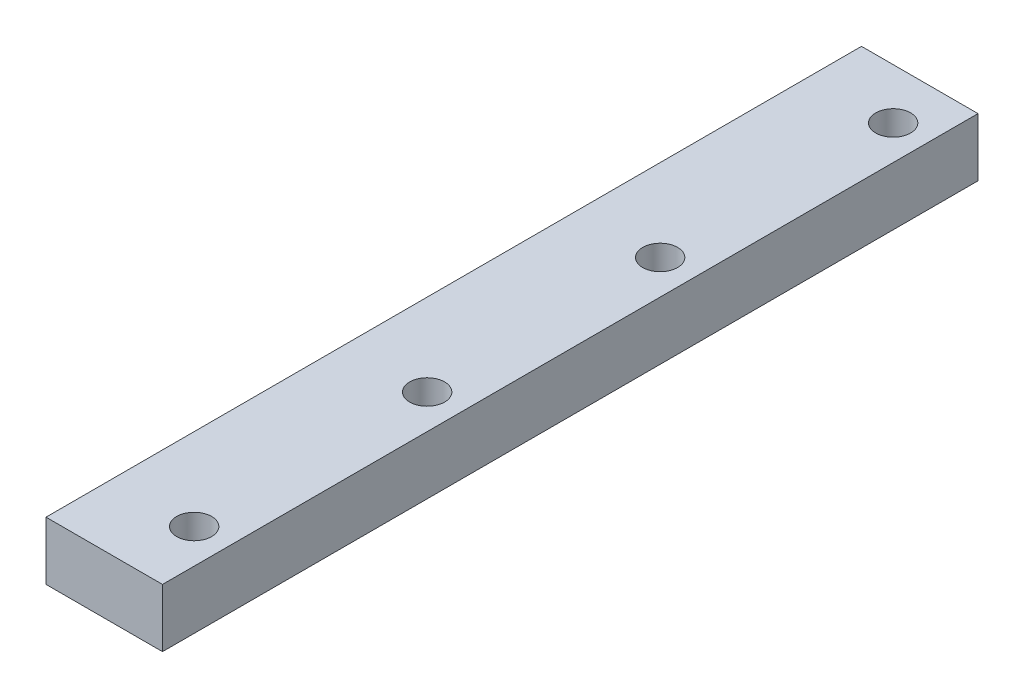
ISO-10303-21;
HEADER;
FILE_DESCRIPTION(('STEP AP214'),'2;1');
FILE_NAME('part.step','',(''),(''),'','','');
FILE_SCHEMA(('AUTOMOTIVE_DESIGN { 1 0 10303 214 1 1 1 1 }'));
ENDSEC;
DATA;
#1=APPLICATION_CONTEXT('core data for automotive mechanical design processes');
#2=APPLICATION_PROTOCOL_DEFINITION('international standard','automotive_design',2000,#1);
#3=PRODUCT_CONTEXT('',#1,'mechanical');
#4=PRODUCT('Part','Part','',(#3));
#5=PRODUCT_RELATED_PRODUCT_CATEGORY('part','',(#4));
#6=PRODUCT_DEFINITION_FORMATION('','',#4);
#7=PRODUCT_DEFINITION_CONTEXT('part definition',#1,'design');
#8=PRODUCT_DEFINITION('design','',#6,#7);
#9=PRODUCT_DEFINITION_SHAPE('','',#8);
#10=(LENGTH_UNIT() NAMED_UNIT(*) SI_UNIT(.MILLI.,.METRE.));
#11=(NAMED_UNIT(*) PLANE_ANGLE_UNIT() SI_UNIT($,.RADIAN.));
#12=(NAMED_UNIT(*) SI_UNIT($,.STERADIAN.) SOLID_ANGLE_UNIT());
#13=UNCERTAINTY_MEASURE_WITH_UNIT(LENGTH_MEASURE(1.E-05),#10,'distance_accuracy_value','');
#14=(GEOMETRIC_REPRESENTATION_CONTEXT(3) GLOBAL_UNCERTAINTY_ASSIGNED_CONTEXT((#13)) GLOBAL_UNIT_ASSIGNED_CONTEXT((#10,
#11,#12)) REPRESENTATION_CONTEXT('',''));
#15=CARTESIAN_POINT('',(0.,0.,0.));
#16=DIRECTION('',(0.,0.,1.));
#17=DIRECTION('',(1.,0.,0.));
#18=AXIS2_PLACEMENT_3D('',#15,#16,#17);
#19=CARTESIAN_POINT('',(14.1085621825044,-119.812030075188,128.673667422913));
#20=DIRECTION('',(0.,1.,0.));
#21=DIRECTION('',(-1.,0.,0.));
#22=AXIS2_PLACEMENT_3D('',#19,#20,#21);
#23=CYLINDRICAL_SURFACE('',#22,3.);
#24=CARTESIAN_POINT('',(14.1085621825043,20.187969924812,128.673667422913));
#25=DIRECTION('',(0.,1.,0.));
#26=DIRECTION('',(-1.,0.,0.));
#27=AXIS2_PLACEMENT_3D('',#24,#25,#26);
#28=CIRCLE('',#27,3.);
#29=CARTESIAN_POINT('',(11.1085621825043,20.187969924812,128.673667422913));
#30=VERTEX_POINT('',#29);
#31=EDGE_CURVE('E42',#30,#30,#28,.T.);
#32=ORIENTED_EDGE('',*,*,#31,.T.);
#33=EDGE_LOOP('',(#32));
#34=FACE_BOUND('',#33,.T.);
#35=CARTESIAN_POINT('',(14.1085621825043,10.187969924812,128.673667422913));
#36=DIRECTION('',(0.,1.,0.));
#37=DIRECTION('',(-1.,0.,0.));
#38=AXIS2_PLACEMENT_3D('',#35,#36,#37);
#39=CIRCLE('',#38,3.);
#40=CARTESIAN_POINT('',(11.1085621825043,10.187969924812,128.673667422913));
#41=VERTEX_POINT('',#40);
#42=EDGE_CURVE('E11',#41,#41,#39,.T.);
#43=ORIENTED_EDGE('',*,*,#42,.F.);
#44=EDGE_LOOP('',(#43));
#45=FACE_BOUND('',#44,.T.);
#46=ADVANCED_FACE('F34',(#34,#45),#23,.F.);
#47=CARTESIAN_POINT('',(14.1085621825044,-119.812030075188,88.673667422913));
#48=DIRECTION('',(0.,1.,0.));
#49=DIRECTION('',(-1.,0.,0.));
#50=AXIS2_PLACEMENT_3D('',#47,#48,#49);
#51=CYLINDRICAL_SURFACE('',#50,3.);
#52=CARTESIAN_POINT('',(14.1085621825043,20.187969924812,88.673667422913));
#53=DIRECTION('',(0.,1.,0.));
#54=DIRECTION('',(-1.,0.,0.));
#55=AXIS2_PLACEMENT_3D('',#52,#53,#54);
#56=CIRCLE('',#55,3.);
#57=CARTESIAN_POINT('',(11.1085621825043,20.187969924812,88.673667422913));
#58=VERTEX_POINT('',#57);
#59=EDGE_CURVE('E112',#58,#58,#56,.T.);
#60=ORIENTED_EDGE('',*,*,#59,.T.);
#61=EDGE_LOOP('',(#60));
#62=FACE_BOUND('',#61,.T.);
#63=CARTESIAN_POINT('',(14.1085621825043,10.187969924812,88.673667422913));
#64=DIRECTION('',(0.,1.,0.));
#65=DIRECTION('',(-1.,0.,0.));
#66=AXIS2_PLACEMENT_3D('',#63,#64,#65);
#67=CIRCLE('',#66,3.);
#68=CARTESIAN_POINT('',(11.1085621825043,10.187969924812,88.673667422913));
#69=VERTEX_POINT('',#68);
#70=EDGE_CURVE('E118',#69,#69,#67,.T.);
#71=ORIENTED_EDGE('',*,*,#70,.F.);
#72=EDGE_LOOP('',(#71));
#73=FACE_BOUND('',#72,.T.);
#74=ADVANCED_FACE('F135',(#62,#73),#51,.F.);
#75=CARTESIAN_POINT('',(20.,10.187969924812,140.));
#76=DIRECTION('',(-1.,0.,0.));
#77=DIRECTION('',(0.,0.,1.));
#78=AXIS2_PLACEMENT_3D('',#75,#76,#77);
#79=PLANE('',#78);
#80=DIRECTION('',(0.,1.,0.));
#81=VECTOR('',#80,1.);
#82=CARTESIAN_POINT('',(20.,10.187969924812,0.));
#83=LINE('',#82,#81);
#84=CARTESIAN_POINT('',(20.,10.187969924812,0.));
#85=VERTEX_POINT('',#84);
#86=CARTESIAN_POINT('',(20.,20.187969924812,0.));
#87=VERTEX_POINT('',#86);
#88=EDGE_CURVE('E102',#85,#87,#83,.T.);
#89=ORIENTED_EDGE('',*,*,#88,.T.);
#90=DIRECTION('',(0.,0.,-1.));
#91=VECTOR('',#90,1.);
#92=CARTESIAN_POINT('',(20.,20.187969924812,140.));
#93=LINE('',#92,#91);
#94=CARTESIAN_POINT('',(20.,20.187969924812,140.));
#95=VERTEX_POINT('',#94);
#96=EDGE_CURVE('E93',#95,#87,#93,.T.);
#97=ORIENTED_EDGE('',*,*,#96,.F.);
#98=DIRECTION('',(0.,1.,0.));
#99=VECTOR('',#98,1.);
#100=CARTESIAN_POINT('',(20.,10.187969924812,140.));
#101=LINE('',#100,#99);
#102=CARTESIAN_POINT('',(20.,10.187969924812,140.));
#103=VERTEX_POINT('',#102);
#104=EDGE_CURVE('E86',#103,#95,#101,.T.);
#105=ORIENTED_EDGE('',*,*,#104,.F.);
#106=DIRECTION('',(0.,0.,-1.));
#107=VECTOR('',#106,1.);
#108=CARTESIAN_POINT('',(20.,10.187969924812,140.));
#109=LINE('',#108,#107);
#110=EDGE_CURVE('E98',#103,#85,#109,.T.);
#111=ORIENTED_EDGE('',*,*,#110,.T.);
#112=EDGE_LOOP('',(#89,#97,#105,#111));
#113=FACE_BOUND('',#112,.T.);
#114=ADVANCED_FACE('F126',(#113),#79,.F.);
#115=CARTESIAN_POINT('',(20.,20.187969924812,140.));
#116=DIRECTION('',(0.,-1.,0.));
#117=DIRECTION('',(1.,0.,0.));
#118=AXIS2_PLACEMENT_3D('',#115,#116,#117);
#119=PLANE('',#118);
#120=CARTESIAN_POINT('',(14.1085621825043,20.187969924812,48.673667422913));
#121=DIRECTION('',(0.,1.,0.));
#122=DIRECTION('',(-1.,0.,0.));
#123=AXIS2_PLACEMENT_3D('',#120,#121,#122);
#124=CIRCLE('',#123,3.);
#125=CARTESIAN_POINT('',(11.1085621825043,20.187969924812,48.673667422913));
#126=VERTEX_POINT('',#125);
#127=EDGE_CURVE('E178',#126,#126,#124,.T.);
#128=ORIENTED_EDGE('',*,*,#127,.F.);
#129=EDGE_LOOP('',(#128));
#130=FACE_BOUND('',#129,.T.);
#131=CARTESIAN_POINT('',(14.1085621825043,20.187969924812,8.67366742291299));
#132=DIRECTION('',(0.,1.,0.));
#133=DIRECTION('',(-1.,0.,0.));
#134=AXIS2_PLACEMENT_3D('',#131,#132,#133);
#135=CIRCLE('',#134,3.);
#136=CARTESIAN_POINT('',(11.1085621825043,20.187969924812,8.67366742291299));
#137=VERTEX_POINT('',#136);
#138=EDGE_CURVE('E115',#137,#137,#135,.T.);
#139=ORIENTED_EDGE('',*,*,#138,.F.);
#140=EDGE_LOOP('',(#139));
#141=FACE_BOUND('',#140,.T.);
#142=DIRECTION('',(-1.,0.,0.));
#143=VECTOR('',#142,1.);
#144=CARTESIAN_POINT('',(20.,20.187969924812,0.));
#145=LINE('',#144,#143);
#146=CARTESIAN_POINT('',(0.,20.187969924812,0.));
#147=VERTEX_POINT('',#146);
#148=EDGE_CURVE('E92',#87,#147,#145,.T.);
#149=ORIENTED_EDGE('',*,*,#148,.T.);
#150=DIRECTION('',(0.,0.,-1.));
#151=VECTOR('',#150,1.);
#152=CARTESIAN_POINT('',(0.,20.187969924812,140.));
#153=LINE('',#152,#151);
#154=CARTESIAN_POINT('',(0.,20.187969924812,140.));
#155=VERTEX_POINT('',#154);
#156=EDGE_CURVE('E89',#155,#147,#153,.T.);
#157=ORIENTED_EDGE('',*,*,#156,.F.);
#158=DIRECTION('',(-1.,0.,0.));
#159=VECTOR('',#158,1.);
#160=CARTESIAN_POINT('',(20.,20.187969924812,140.));
#161=LINE('',#160,#159);
#162=EDGE_CURVE('E81',#95,#155,#161,.T.);
#163=ORIENTED_EDGE('',*,*,#162,.F.);
#164=ORIENTED_EDGE('',*,*,#96,.T.);
#165=EDGE_LOOP('',(#149,#157,#163,#164));
#166=FACE_BOUND('',#165,.T.);
#167=ORIENTED_EDGE('',*,*,#59,.F.);
#168=EDGE_LOOP('',(#167));
#169=FACE_BOUND('',#168,.T.);
#170=ORIENTED_EDGE('',*,*,#31,.F.);
#171=EDGE_LOOP('',(#170));
#172=FACE_BOUND('',#171,.T.);
#173=ADVANCED_FACE('F90',(#130,#141,#166,#169,#172),#119,.F.);
#174=CARTESIAN_POINT('',(0.,20.187969924812,140.));
#175=DIRECTION('',(1.,0.,0.));
#176=DIRECTION('',(0.,1.,0.));
#177=AXIS2_PLACEMENT_3D('',#174,#175,#176);
#178=PLANE('',#177);
#179=DIRECTION('',(0.,-1.,0.));
#180=VECTOR('',#179,1.);
#181=CARTESIAN_POINT('',(0.,20.187969924812,0.));
#182=LINE('',#181,#180);
#183=CARTESIAN_POINT('',(0.,10.187969924812,0.));
#184=VERTEX_POINT('',#183);
#185=EDGE_CURVE('E67',#147,#184,#182,.T.);
#186=ORIENTED_EDGE('',*,*,#185,.T.);
#187=DIRECTION('',(0.,0.,-1.));
#188=VECTOR('',#187,1.);
#189=CARTESIAN_POINT('',(0.,10.187969924812,140.));
#190=LINE('',#189,#188);
#191=CARTESIAN_POINT('',(0.,10.187969924812,140.));
#192=VERTEX_POINT('',#191);
#193=EDGE_CURVE('E94',#192,#184,#190,.T.);
#194=ORIENTED_EDGE('',*,*,#193,.F.);
#195=DIRECTION('',(0.,-1.,0.));
#196=VECTOR('',#195,1.);
#197=CARTESIAN_POINT('',(0.,20.187969924812,140.));
#198=LINE('',#197,#196);
#199=EDGE_CURVE('E84',#155,#192,#198,.T.);
#200=ORIENTED_EDGE('',*,*,#199,.F.);
#201=ORIENTED_EDGE('',*,*,#156,.T.);
#202=EDGE_LOOP('',(#186,#194,#200,#201));
#203=FACE_BOUND('',#202,.T.);
#204=ADVANCED_FACE('F96',(#203),#178,.F.);
#205=CARTESIAN_POINT('',(0.,10.187969924812,140.));
#206=DIRECTION('',(0.,1.,0.));
#207=DIRECTION('',(-1.,0.,0.));
#208=AXIS2_PLACEMENT_3D('',#205,#206,#207);
#209=PLANE('',#208);
#210=CARTESIAN_POINT('',(14.1085621825043,10.187969924812,48.673667422913));
#211=DIRECTION('',(0.,1.,0.));
#212=DIRECTION('',(-1.,0.,0.));
#213=AXIS2_PLACEMENT_3D('',#210,#211,#212);
#214=CIRCLE('',#213,3.);
#215=CARTESIAN_POINT('',(11.1085621825043,10.187969924812,48.673667422913));
#216=VERTEX_POINT('',#215);
#217=EDGE_CURVE('E180',#216,#216,#214,.T.);
#218=ORIENTED_EDGE('',*,*,#217,.T.);
#219=EDGE_LOOP('',(#218));
#220=FACE_BOUND('',#219,.T.);
#221=CARTESIAN_POINT('',(14.1085621825043,10.187969924812,8.67366742291299));
#222=DIRECTION('',(0.,1.,0.));
#223=DIRECTION('',(-1.,0.,0.));
#224=AXIS2_PLACEMENT_3D('',#221,#222,#223);
#225=CIRCLE('',#224,3.);
#226=CARTESIAN_POINT('',(11.1085621825043,10.187969924812,8.67366742291299));
#227=VERTEX_POINT('',#226);
#228=EDGE_CURVE('E105',#227,#227,#225,.T.);
#229=ORIENTED_EDGE('',*,*,#228,.T.);
#230=EDGE_LOOP('',(#229));
#231=FACE_BOUND('',#230,.T.);
#232=DIRECTION('',(1.,0.,0.));
#233=VECTOR('',#232,1.);
#234=CARTESIAN_POINT('',(0.,10.187969924812,0.));
#235=LINE('',#234,#233);
#236=EDGE_CURVE('E73',#184,#85,#235,.T.);
#237=ORIENTED_EDGE('',*,*,#236,.T.);
#238=ORIENTED_EDGE('',*,*,#110,.F.);
#239=DIRECTION('',(1.,0.,0.));
#240=VECTOR('',#239,1.);
#241=CARTESIAN_POINT('',(0.,10.187969924812,140.));
#242=LINE('',#241,#240);
#243=EDGE_CURVE('E50',#192,#103,#242,.T.);
#244=ORIENTED_EDGE('',*,*,#243,.F.);
#245=ORIENTED_EDGE('',*,*,#193,.T.);
#246=EDGE_LOOP('',(#237,#238,#244,#245));
#247=FACE_BOUND('',#246,.T.);
#248=ORIENTED_EDGE('',*,*,#70,.T.);
#249=EDGE_LOOP('',(#248));
#250=FACE_BOUND('',#249,.T.);
#251=ORIENTED_EDGE('',*,*,#42,.T.);
#252=EDGE_LOOP('',(#251));
#253=FACE_BOUND('',#252,.T.);
#254=ADVANCED_FACE('F133',(#220,#231,#247,#250,#253),#209,.F.);
#255=CARTESIAN_POINT('',(0.,0.,140.));
#256=DIRECTION('',(0.,0.,1.));
#257=DIRECTION('',(1.,0.,0.));
#258=AXIS2_PLACEMENT_3D('',#255,#256,#257);
#259=PLANE('',#258);
#260=ORIENTED_EDGE('',*,*,#104,.T.);
#261=ORIENTED_EDGE('',*,*,#162,.T.);
#262=ORIENTED_EDGE('',*,*,#199,.T.);
#263=ORIENTED_EDGE('',*,*,#243,.T.);
#264=EDGE_LOOP('',(#260,#261,#262,#263));
#265=FACE_BOUND('',#264,.T.);
#266=ADVANCED_FACE('F82',(#265),#259,.T.);
#267=CARTESIAN_POINT('',(0.,0.,0.));
#268=DIRECTION('',(0.,0.,1.));
#269=DIRECTION('',(1.,0.,0.));
#270=AXIS2_PLACEMENT_3D('',#267,#268,#269);
#271=PLANE('',#270);
#272=ORIENTED_EDGE('',*,*,#88,.F.);
#273=ORIENTED_EDGE('',*,*,#236,.F.);
#274=ORIENTED_EDGE('',*,*,#185,.F.);
#275=ORIENTED_EDGE('',*,*,#148,.F.);
#276=EDGE_LOOP('',(#272,#273,#274,#275));
#277=FACE_BOUND('',#276,.T.);
#278=ADVANCED_FACE('F159',(#277),#271,.F.);
#279=CARTESIAN_POINT('',(14.1085621825044,-119.812030075188,8.67366742291299));
#280=DIRECTION('',(0.,1.,0.));
#281=DIRECTION('',(-1.,0.,0.));
#282=AXIS2_PLACEMENT_3D('',#279,#280,#281);
#283=CYLINDRICAL_SURFACE('',#282,3.);
#284=ORIENTED_EDGE('',*,*,#138,.T.);
#285=EDGE_LOOP('',(#284));
#286=FACE_BOUND('',#285,.T.);
#287=ORIENTED_EDGE('',*,*,#228,.F.);
#288=EDGE_LOOP('',(#287));
#289=FACE_BOUND('',#288,.T.);
#290=ADVANCED_FACE('F165',(#286,#289),#283,.F.);
#291=CARTESIAN_POINT('',(14.1085621825044,-119.812030075188,48.673667422913));
#292=DIRECTION('',(0.,1.,0.));
#293=DIRECTION('',(-1.,0.,0.));
#294=AXIS2_PLACEMENT_3D('',#291,#292,#293);
#295=CYLINDRICAL_SURFACE('',#294,3.);
#296=ORIENTED_EDGE('',*,*,#127,.T.);
#297=EDGE_LOOP('',(#296));
#298=FACE_BOUND('',#297,.T.);
#299=ORIENTED_EDGE('',*,*,#217,.F.);
#300=EDGE_LOOP('',(#299));
#301=FACE_BOUND('',#300,.T.);
#302=ADVANCED_FACE('F170',(#298,#301),#295,.F.);
#303=CLOSED_SHELL('',(#46,#74,#114,#173,#204,#254,#266,#278,#290,#302));
#304=MANIFOLD_SOLID_BREP('B2',#303);
#305=ADVANCED_BREP_SHAPE_REPRESENTATION('',(#18,#304),#14);
#306=SHAPE_DEFINITION_REPRESENTATION(#9,#305);
ENDSEC;
END-ISO-10303-21;
